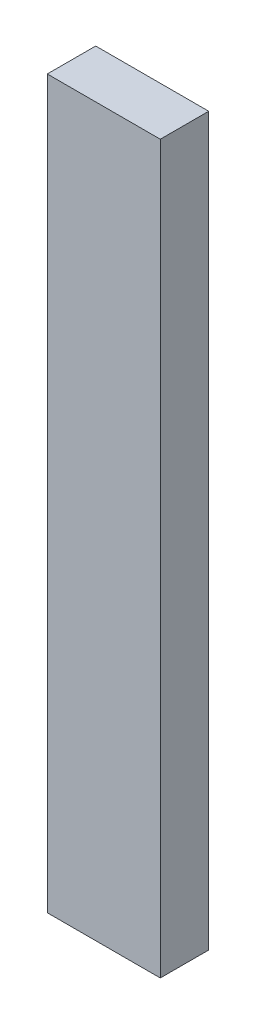
ISO-10303-21;
HEADER;
FILE_DESCRIPTION(('STEP AP214'),'2;1');
FILE_NAME('part.step','',(''),(''),'','','');
FILE_SCHEMA(('AUTOMOTIVE_DESIGN { 1 0 10303 214 1 1 1 1 }'));
ENDSEC;
DATA;
#1=APPLICATION_CONTEXT('core data for automotive mechanical design processes');
#2=APPLICATION_PROTOCOL_DEFINITION('international standard','automotive_design',2000,#1);
#3=PRODUCT_CONTEXT('',#1,'mechanical');
#4=PRODUCT('Part','Part','',(#3));
#5=PRODUCT_RELATED_PRODUCT_CATEGORY('part','',(#4));
#6=PRODUCT_DEFINITION_FORMATION('','',#4);
#7=PRODUCT_DEFINITION_CONTEXT('part definition',#1,'design');
#8=PRODUCT_DEFINITION('design','',#6,#7);
#9=PRODUCT_DEFINITION_SHAPE('','',#8);
#10=(LENGTH_UNIT() NAMED_UNIT(*) SI_UNIT(.MILLI.,.METRE.));
#11=(NAMED_UNIT(*) PLANE_ANGLE_UNIT() SI_UNIT($,.RADIAN.));
#12=(NAMED_UNIT(*) SI_UNIT($,.STERADIAN.) SOLID_ANGLE_UNIT());
#13=UNCERTAINTY_MEASURE_WITH_UNIT(LENGTH_MEASURE(1.E-05),#10,'distance_accuracy_value','');
#14=(GEOMETRIC_REPRESENTATION_CONTEXT(3) GLOBAL_UNCERTAINTY_ASSIGNED_CONTEXT((#13)) GLOBAL_UNIT_ASSIGNED_CONTEXT((#10,
#11,#12)) REPRESENTATION_CONTEXT('',''));
#15=CARTESIAN_POINT('',(0.,0.,0.));
#16=DIRECTION('',(0.,0.,1.));
#17=DIRECTION('',(1.,0.,0.));
#18=AXIS2_PLACEMENT_3D('',#15,#16,#17);
#19=CARTESIAN_POINT('',(0.,0.,3.81));
#20=DIRECTION('',(0.,1.,0.));
#21=DIRECTION('',(0.,0.,1.));
#22=AXIS2_PLACEMENT_3D('',#19,#20,#21);
#23=PLANE('',#22);
#24=DIRECTION('',(1.,0.,0.));
#25=VECTOR('',#24,1.);
#26=CARTESIAN_POINT('',(0.,0.,0.));
#27=LINE('',#26,#25);
#28=CARTESIAN_POINT('',(-8.89,0.,0.));
#29=VERTEX_POINT('',#28);
#30=CARTESIAN_POINT('',(0.,0.,0.));
#31=VERTEX_POINT('',#30);
#32=EDGE_CURVE('E103',#29,#31,#27,.T.);
#33=ORIENTED_EDGE('',*,*,#32,.T.);
#34=DIRECTION('',(0.,0.,-1.));
#35=VECTOR('',#34,1.);
#36=CARTESIAN_POINT('',(0.,0.,3.81));
#37=LINE('',#36,#35);
#38=CARTESIAN_POINT('',(0.,0.,3.81));
#39=VERTEX_POINT('',#38);
#40=EDGE_CURVE('E11',#39,#31,#37,.T.);
#41=ORIENTED_EDGE('',*,*,#40,.F.);
#42=DIRECTION('',(1.,0.,0.));
#43=VECTOR('',#42,1.);
#44=CARTESIAN_POINT('',(0.,0.,3.81));
#45=LINE('',#44,#43);
#46=CARTESIAN_POINT('',(-8.89,0.,3.81));
#47=VERTEX_POINT('',#46);
#48=EDGE_CURVE('E91',#47,#39,#45,.T.);
#49=ORIENTED_EDGE('',*,*,#48,.F.);
#50=DIRECTION('',(0.,0.,-1.));
#51=VECTOR('',#50,1.);
#52=CARTESIAN_POINT('',(-8.89,0.,3.81));
#53=LINE('',#52,#51);
#54=EDGE_CURVE('E99',#47,#29,#53,.T.);
#55=ORIENTED_EDGE('',*,*,#54,.T.);
#56=EDGE_LOOP('',(#33,#41,#49,#55));
#57=FACE_BOUND('',#56,.T.);
#58=ADVANCED_FACE('F40',(#57),#23,.F.);
#59=CARTESIAN_POINT('',(0.,0.,3.81));
#60=DIRECTION('',(-1.,0.,0.));
#61=DIRECTION('',(0.,0.,1.));
#62=AXIS2_PLACEMENT_3D('',#59,#60,#61);
#63=PLANE('',#62);
#64=DIRECTION('',(0.,1.,0.));
#65=VECTOR('',#64,1.);
#66=CARTESIAN_POINT('',(0.,0.,0.));
#67=LINE('',#66,#65);
#68=CARTESIAN_POINT('',(0.,57.15,0.));
#69=VERTEX_POINT('',#68);
#70=EDGE_CURVE('E95',#31,#69,#67,.T.);
#71=ORIENTED_EDGE('',*,*,#70,.T.);
#72=DIRECTION('',(0.,0.,-1.));
#73=VECTOR('',#72,1.);
#74=CARTESIAN_POINT('',(0.,57.15,3.81));
#75=LINE('',#74,#73);
#76=CARTESIAN_POINT('',(0.,57.15,3.81));
#77=VERTEX_POINT('',#76);
#78=EDGE_CURVE('E48',#77,#69,#75,.T.);
#79=ORIENTED_EDGE('',*,*,#78,.F.);
#80=DIRECTION('',(0.,1.,0.));
#81=VECTOR('',#80,1.);
#82=CARTESIAN_POINT('',(0.,0.,3.81));
#83=LINE('',#82,#81);
#84=EDGE_CURVE('E86',#39,#77,#83,.T.);
#85=ORIENTED_EDGE('',*,*,#84,.F.);
#86=ORIENTED_EDGE('',*,*,#40,.T.);
#87=EDGE_LOOP('',(#71,#79,#85,#86));
#88=FACE_BOUND('',#87,.T.);
#89=ADVANCED_FACE('F94',(#88),#63,.F.);
#90=CARTESIAN_POINT('',(0.,57.15,3.81));
#91=DIRECTION('',(0.,-1.,0.));
#92=DIRECTION('',(0.,0.,-1.));
#93=AXIS2_PLACEMENT_3D('',#90,#91,#92);
#94=PLANE('',#93);
#95=DIRECTION('',(-1.,0.,0.));
#96=VECTOR('',#95,1.);
#97=CARTESIAN_POINT('',(0.,57.15,0.));
#98=LINE('',#97,#96);
#99=CARTESIAN_POINT('',(-8.89,57.15,0.));
#100=VERTEX_POINT('',#99);
#101=EDGE_CURVE('E73',#69,#100,#98,.T.);
#102=ORIENTED_EDGE('',*,*,#101,.T.);
#103=DIRECTION('',(0.,0.,-1.));
#104=VECTOR('',#103,1.);
#105=CARTESIAN_POINT('',(-8.89,57.15,3.81));
#106=LINE('',#105,#104);
#107=CARTESIAN_POINT('',(-8.89,57.15,3.81));
#108=VERTEX_POINT('',#107);
#109=EDGE_CURVE('E96',#108,#100,#106,.T.);
#110=ORIENTED_EDGE('',*,*,#109,.F.);
#111=DIRECTION('',(-1.,0.,0.));
#112=VECTOR('',#111,1.);
#113=CARTESIAN_POINT('',(0.,57.15,3.81));
#114=LINE('',#113,#112);
#115=EDGE_CURVE('E89',#77,#108,#114,.T.);
#116=ORIENTED_EDGE('',*,*,#115,.F.);
#117=ORIENTED_EDGE('',*,*,#78,.T.);
#118=EDGE_LOOP('',(#102,#110,#116,#117));
#119=FACE_BOUND('',#118,.T.);
#120=ADVANCED_FACE('F97',(#119),#94,.F.);
#121=CARTESIAN_POINT('',(-8.89,0.,3.81));
#122=DIRECTION('',(1.,0.,0.));
#123=DIRECTION('',(0.,0.,-1.));
#124=AXIS2_PLACEMENT_3D('',#121,#122,#123);
#125=PLANE('',#124);
#126=DIRECTION('',(0.,-1.,0.));
#127=VECTOR('',#126,1.);
#128=CARTESIAN_POINT('',(-8.89,0.,0.));
#129=LINE('',#128,#127);
#130=EDGE_CURVE('E79',#100,#29,#129,.T.);
#131=ORIENTED_EDGE('',*,*,#130,.T.);
#132=ORIENTED_EDGE('',*,*,#54,.F.);
#133=DIRECTION('',(0.,-1.,0.));
#134=VECTOR('',#133,1.);
#135=CARTESIAN_POINT('',(-8.89,0.,3.81));
#136=LINE('',#135,#134);
#137=EDGE_CURVE('E56',#108,#47,#136,.T.);
#138=ORIENTED_EDGE('',*,*,#137,.F.);
#139=ORIENTED_EDGE('',*,*,#109,.T.);
#140=EDGE_LOOP('',(#131,#132,#138,#139));
#141=FACE_BOUND('',#140,.T.);
#142=ADVANCED_FACE('F110',(#141),#125,.F.);
#143=CARTESIAN_POINT('',(0.,0.,3.81));
#144=DIRECTION('',(0.,0.,-1.));
#145=DIRECTION('',(-1.,0.,0.));
#146=AXIS2_PLACEMENT_3D('',#143,#144,#145);
#147=PLANE('',#146);
#148=ORIENTED_EDGE('',*,*,#48,.T.);
#149=ORIENTED_EDGE('',*,*,#84,.T.);
#150=ORIENTED_EDGE('',*,*,#115,.T.);
#151=ORIENTED_EDGE('',*,*,#137,.T.);
#152=EDGE_LOOP('',(#148,#149,#150,#151));
#153=FACE_BOUND('',#152,.T.);
#154=ADVANCED_FACE('F87',(#153),#147,.F.);
#155=CARTESIAN_POINT('',(0.,0.,0.));
#156=DIRECTION('',(0.,0.,-1.));
#157=DIRECTION('',(-1.,0.,0.));
#158=AXIS2_PLACEMENT_3D('',#155,#156,#157);
#159=PLANE('',#158);
#160=ORIENTED_EDGE('',*,*,#32,.F.);
#161=ORIENTED_EDGE('',*,*,#130,.F.);
#162=ORIENTED_EDGE('',*,*,#101,.F.);
#163=ORIENTED_EDGE('',*,*,#70,.F.);
#164=EDGE_LOOP('',(#160,#161,#162,#163));
#165=FACE_BOUND('',#164,.T.);
#166=ADVANCED_FACE('F113',(#165),#159,.T.);
#167=CLOSED_SHELL('',(#58,#89,#120,#142,#154,#166));
#168=MANIFOLD_SOLID_BREP('B2',#167);
#169=ADVANCED_BREP_SHAPE_REPRESENTATION('',(#18,#168),#14);
#170=SHAPE_DEFINITION_REPRESENTATION(#9,#169);
ENDSEC;
END-ISO-10303-21;
